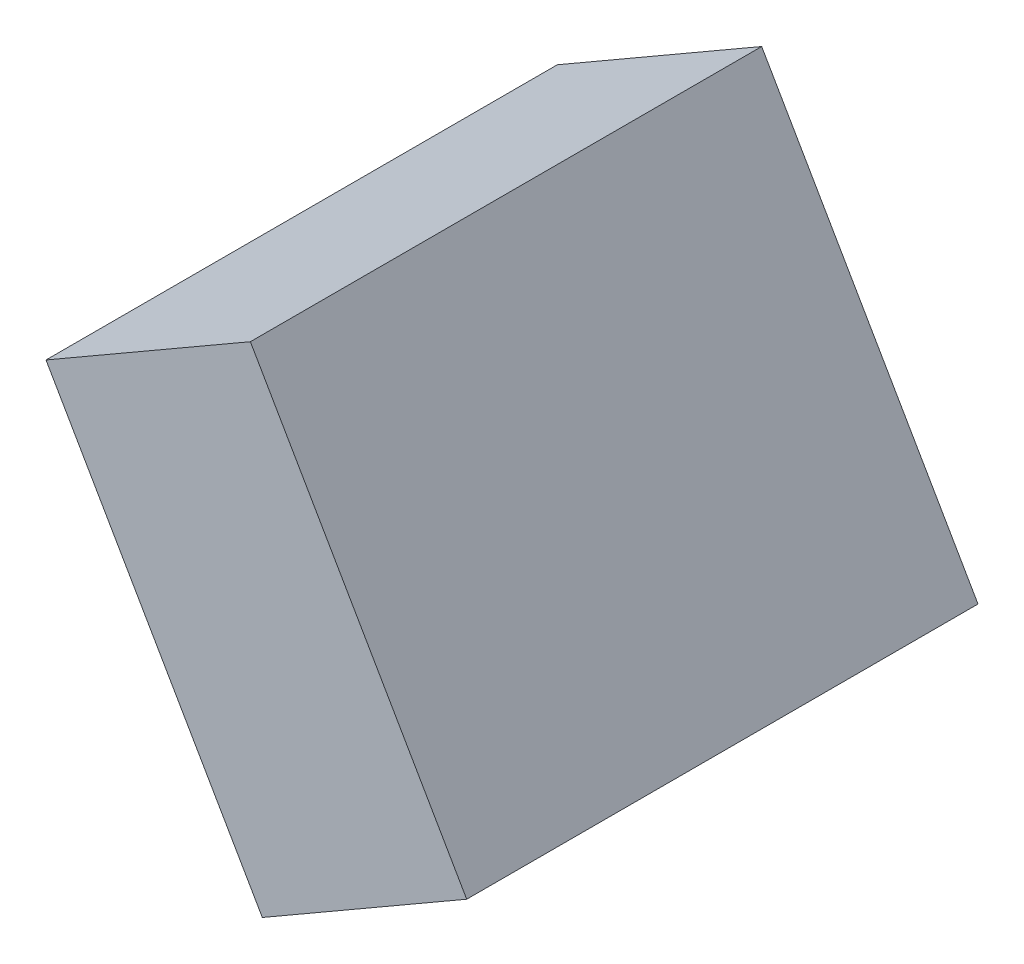
ISO-10303-21;
HEADER;
FILE_DESCRIPTION(('STEP AP214'),'2;1');
FILE_NAME('part.step','',(''),(''),'','','');
FILE_SCHEMA(('AUTOMOTIVE_DESIGN { 1 0 10303 214 1 1 1 1 }'));
ENDSEC;
DATA;
#1=APPLICATION_CONTEXT('core data for automotive mechanical design processes');
#2=APPLICATION_PROTOCOL_DEFINITION('international standard','automotive_design',2000,#1);
#3=PRODUCT_CONTEXT('',#1,'mechanical');
#4=PRODUCT('Part','Part','',(#3));
#5=PRODUCT_RELATED_PRODUCT_CATEGORY('part','',(#4));
#6=PRODUCT_DEFINITION_FORMATION('','',#4);
#7=PRODUCT_DEFINITION_CONTEXT('part definition',#1,'design');
#8=PRODUCT_DEFINITION('design','',#6,#7);
#9=PRODUCT_DEFINITION_SHAPE('','',#8);
#10=(LENGTH_UNIT() NAMED_UNIT(*) SI_UNIT(.MILLI.,.METRE.));
#11=(NAMED_UNIT(*) PLANE_ANGLE_UNIT() SI_UNIT($,.RADIAN.));
#12=(NAMED_UNIT(*) SI_UNIT($,.STERADIAN.) SOLID_ANGLE_UNIT());
#13=UNCERTAINTY_MEASURE_WITH_UNIT(LENGTH_MEASURE(1.E-05),#10,'distance_accuracy_value','');
#14=(GEOMETRIC_REPRESENTATION_CONTEXT(3) GLOBAL_UNCERTAINTY_ASSIGNED_CONTEXT((#13)) GLOBAL_UNIT_ASSIGNED_CONTEXT((#10,
#11,#12)) REPRESENTATION_CONTEXT('',''));
#15=CARTESIAN_POINT('',(0.,0.,0.));
#16=DIRECTION('',(0.,0.,1.));
#17=DIRECTION('',(1.,0.,0.));
#18=AXIS2_PLACEMENT_3D('',#15,#16,#17);
#19=CARTESIAN_POINT('',(-0.53480462,0.3263138,0.));
#20=DIRECTION('',(0.866024622348075,0.500001353485043,0.));
#21=DIRECTION('',(-0.500001353485043,0.866024622348075,0.));
#22=AXIS2_PLACEMENT_3D('',#19,#20,#21);
#23=PLANE('',#22);
#24=DIRECTION('',(0.,0.,1.));
#25=VECTOR('',#24,1.);
#26=CARTESIAN_POINT('',(0.01519682,-0.6263132,0.));
#27=LINE('',#26,#25);
#28=CARTESIAN_POINT('',(0.0151968199998915,-0.626313200000063,0.));
#29=VERTEX_POINT('',#28);
#30=CARTESIAN_POINT('',(0.0151968199998915,-0.626313200000063,1.29999994));
#31=VERTEX_POINT('',#30);
#32=EDGE_CURVE('E19',#29,#31,#27,.T.);
#33=ORIENTED_EDGE('',*,*,#32,.T.);
#34=DIRECTION('',(-0.500001353485438,0.866024622347847,0.));
#35=VECTOR('',#34,1.);
#36=CARTESIAN_POINT('',(0.01519682,-0.6263132,1.29999994));
#37=LINE('',#36,#35);
#38=CARTESIAN_POINT('',(-0.534804620000028,0.326313800000049,1.29999994));
#39=VERTEX_POINT('',#38);
#40=EDGE_CURVE('E54',#31,#39,#37,.T.);
#41=ORIENTED_EDGE('',*,*,#40,.T.);
#42=DIRECTION('',(0.,0.,1.));
#43=VECTOR('',#42,1.);
#44=CARTESIAN_POINT('',(-0.534804620000113,0.326313800000195,0.));
#45=LINE('',#44,#43);
#46=CARTESIAN_POINT('',(-0.534804620000056,0.326313800000098,0.));
#47=VERTEX_POINT('',#46);
#48=EDGE_CURVE('E75',#39,#47,#45,.F.);
#49=ORIENTED_EDGE('',*,*,#48,.T.);
#50=DIRECTION('',(-0.500001353485438,0.866024622347847,0.));
#51=VECTOR('',#50,1.);
#52=CARTESIAN_POINT('',(0.01519682,-0.6263132,0.));
#53=LINE('',#52,#51);
#54=EDGE_CURVE('E57',#29,#47,#53,.T.);
#55=ORIENTED_EDGE('',*,*,#54,.F.);
#56=EDGE_LOOP('',(#33,#41,#49,#55));
#57=FACE_BOUND('',#56,.T.);
#58=ADVANCED_FACE('F16',(#57),#23,.F.);
#59=CARTESIAN_POINT('',(0.01519682,-0.6263132,0.));
#60=DIRECTION('',(-0.499999612904881,0.866025627273794,0.));
#61=DIRECTION('',(-0.866025627273794,-0.499999612904881,0.));
#62=AXIS2_PLACEMENT_3D('',#59,#60,#61);
#63=PLANE('',#62);
#64=DIRECTION('',(0.,0.,1.));
#65=VECTOR('',#64,1.);
#66=CARTESIAN_POINT('',(0.53480716,-0.32631634,0.));
#67=LINE('',#66,#65);
#68=CARTESIAN_POINT('',(0.534807160000074,-0.326316340000128,0.));
#69=VERTEX_POINT('',#68);
#70=CARTESIAN_POINT('',(0.534807160000074,-0.326316340000128,1.29999994));
#71=VERTEX_POINT('',#70);
#72=EDGE_CURVE('E72',#69,#71,#67,.T.);
#73=ORIENTED_EDGE('',*,*,#72,.T.);
#74=DIRECTION('',(-0.866025627273549,-0.499999612905307,0.));
#75=VECTOR('',#74,1.);
#76=CARTESIAN_POINT('',(0.53480716,-0.32631634,1.29999994));
#77=LINE('',#76,#75);
#78=EDGE_CURVE('E62',#71,#31,#77,.T.);
#79=ORIENTED_EDGE('',*,*,#78,.T.);
#80=ORIENTED_EDGE('',*,*,#32,.F.);
#81=DIRECTION('',(-0.866025627273549,-0.499999612905307,0.));
#82=VECTOR('',#81,1.);
#83=CARTESIAN_POINT('',(0.53480716,-0.32631634,0.));
#84=LINE('',#83,#82);
#85=EDGE_CURVE('E78',#69,#29,#84,.T.);
#86=ORIENTED_EDGE('',*,*,#85,.F.);
#87=EDGE_LOOP('',(#73,#79,#80,#86));
#88=FACE_BOUND('',#87,.T.);
#89=ADVANCED_FACE('F71',(#88),#63,.F.);
#90=CARTESIAN_POINT('',(-0.53480462,0.3263138,1.29999994));
#91=DIRECTION('',(0.,0.,-1.));
#92=DIRECTION('',(-1.,0.,0.));
#93=AXIS2_PLACEMENT_3D('',#90,#91,#92);
#94=PLANE('',#93);
#95=ORIENTED_EDGE('',*,*,#78,.F.);
#96=DIRECTION('',(0.499998621801984,-0.866026199485972,0.));
#97=VECTOR('',#96,1.);
#98=CARTESIAN_POINT('',(0.53480716,-0.32631634,1.29999994));
#99=LINE('',#98,#97);
#100=CARTESIAN_POINT('',(-0.0151917399998767,0.626313200000077,1.29999994));
#101=VERTEX_POINT('',#100);
#102=EDGE_CURVE('E82',#71,#101,#99,.F.);
#103=ORIENTED_EDGE('',*,*,#102,.T.);
#104=DIRECTION('',(0.8660248525152,0.500000954825115,0.));
#105=VECTOR('',#104,1.);
#106=CARTESIAN_POINT('',(-0.01519174000001,0.6263132,1.29999994));
#107=LINE('',#106,#105);
#108=EDGE_CURVE('E68',#101,#39,#107,.F.);
#109=ORIENTED_EDGE('',*,*,#108,.T.);
#110=ORIENTED_EDGE('',*,*,#40,.F.);
#111=EDGE_LOOP('',(#95,#103,#109,#110));
#112=FACE_BOUND('',#111,.T.);
#113=ADVANCED_FACE('F65',(#112),#94,.F.);
#114=CARTESIAN_POINT('',(-0.01519174000001,0.6263132,0.));
#115=DIRECTION('',(0.500000954825115,-0.8660248525152,0.));
#116=DIRECTION('',(0.8660248525152,0.500000954825115,0.));
#117=AXIS2_PLACEMENT_3D('',#114,#115,#116);
#118=PLANE('',#117);
#119=ORIENTED_EDGE('',*,*,#48,.F.);
#120=ORIENTED_EDGE('',*,*,#108,.F.);
#121=DIRECTION('',(0.,0.,1.));
#122=VECTOR('',#121,1.);
#123=CARTESIAN_POINT('',(-0.0151917399994766,0.626313200000308,0.));
#124=LINE('',#123,#122);
#125=CARTESIAN_POINT('',(-0.0151917399998767,0.626313200000077,0.));
#126=VERTEX_POINT('',#125);
#127=EDGE_CURVE('E25',#101,#126,#124,.F.);
#128=ORIENTED_EDGE('',*,*,#127,.T.);
#129=DIRECTION('',(0.866024852515012,0.500000954825441,0.));
#130=VECTOR('',#129,1.);
#131=CARTESIAN_POINT('',(-0.53480462,0.3263138,0.));
#132=LINE('',#131,#130);
#133=EDGE_CURVE('E33',#47,#126,#132,.T.);
#134=ORIENTED_EDGE('',*,*,#133,.F.);
#135=EDGE_LOOP('',(#119,#120,#128,#134));
#136=FACE_BOUND('',#135,.T.);
#137=ADVANCED_FACE('F87',(#136),#118,.F.);
#138=CARTESIAN_POINT('',(-0.53480462,0.3263138,0.));
#139=DIRECTION('',(0.,0.,-1.));
#140=DIRECTION('',(-1.,0.,0.));
#141=AXIS2_PLACEMENT_3D('',#138,#139,#140);
#142=PLANE('',#141);
#143=ORIENTED_EDGE('',*,*,#85,.T.);
#144=ORIENTED_EDGE('',*,*,#54,.T.);
#145=ORIENTED_EDGE('',*,*,#133,.T.);
#146=DIRECTION('',(0.499998621801984,-0.866026199485972,0.));
#147=VECTOR('',#146,1.);
#148=CARTESIAN_POINT('',(0.53480716,-0.32631634,0.));
#149=LINE('',#148,#147);
#150=EDGE_CURVE('E11',#126,#69,#149,.T.);
#151=ORIENTED_EDGE('',*,*,#150,.T.);
#152=EDGE_LOOP('',(#143,#144,#145,#151));
#153=FACE_BOUND('',#152,.T.);
#154=ADVANCED_FACE('F90',(#153),#142,.T.);
#155=CARTESIAN_POINT('',(0.53480716,-0.32631634,0.));
#156=DIRECTION('',(-0.866026199485972,-0.499998621801984,0.));
#157=DIRECTION('',(0.499998621801984,-0.866026199485972,0.));
#158=AXIS2_PLACEMENT_3D('',#155,#156,#157);
#159=PLANE('',#158);
#160=ORIENTED_EDGE('',*,*,#127,.F.);
#161=ORIENTED_EDGE('',*,*,#102,.F.);
#162=ORIENTED_EDGE('',*,*,#72,.F.);
#163=ORIENTED_EDGE('',*,*,#150,.F.);
#164=EDGE_LOOP('',(#160,#161,#162,#163));
#165=FACE_BOUND('',#164,.T.);
#166=ADVANCED_FACE('F89',(#165),#159,.F.);
#167=CLOSED_SHELL('',(#58,#89,#113,#137,#154,#166));
#168=MANIFOLD_SOLID_BREP('B1',#167);
#169=ADVANCED_BREP_SHAPE_REPRESENTATION('',(#18,#168),#14);
#170=SHAPE_DEFINITION_REPRESENTATION(#9,#169);
ENDSEC;
END-ISO-10303-21;
